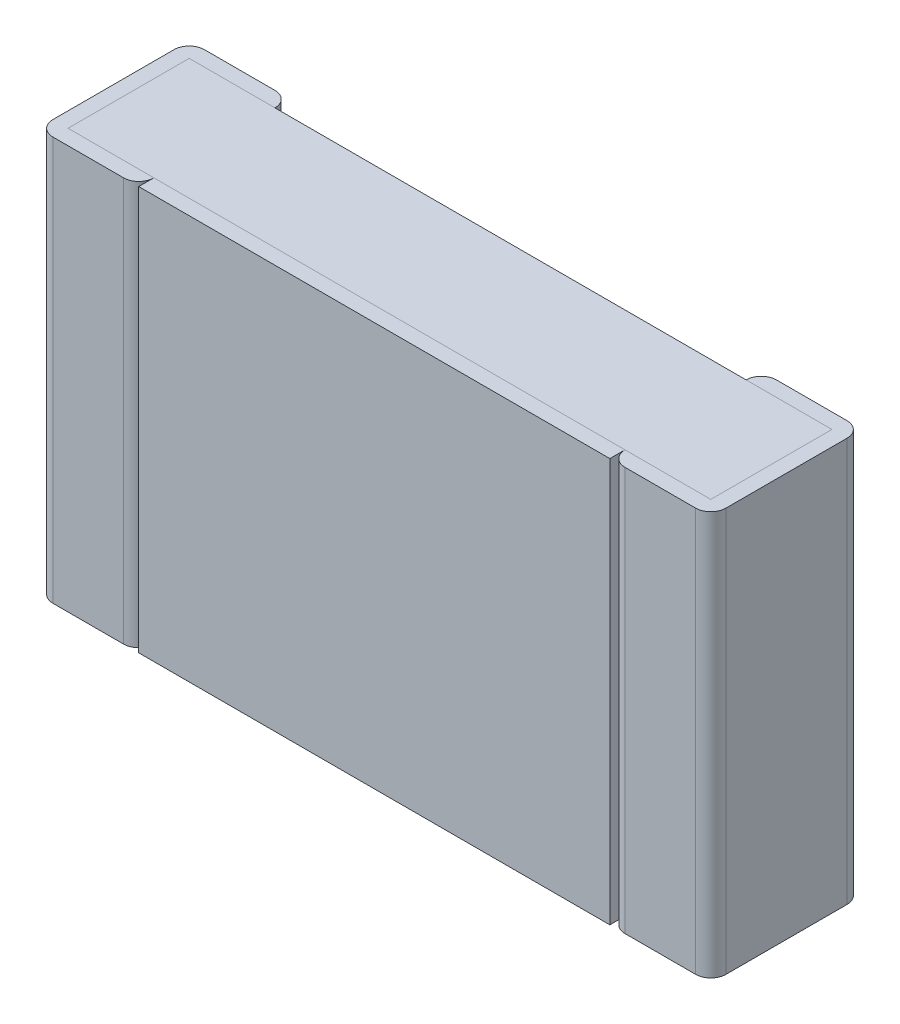
ISO-10303-21;
HEADER;
FILE_DESCRIPTION(('STEP AP214'),'2;1');
FILE_NAME('part.step','',(''),(''),'','','');
FILE_SCHEMA(('AUTOMOTIVE_DESIGN { 1 0 10303 214 1 1 1 1 }'));
ENDSEC;
DATA;
#1=APPLICATION_CONTEXT('core data for automotive mechanical design processes');
#2=APPLICATION_PROTOCOL_DEFINITION('international standard','automotive_design',2000,#1);
#3=PRODUCT_CONTEXT('',#1,'mechanical');
#4=PRODUCT('Part','Part','',(#3));
#5=PRODUCT_RELATED_PRODUCT_CATEGORY('part','',(#4));
#6=PRODUCT_DEFINITION_FORMATION('','',#4);
#7=PRODUCT_DEFINITION_CONTEXT('part definition',#1,'design');
#8=PRODUCT_DEFINITION('design','',#6,#7);
#9=PRODUCT_DEFINITION_SHAPE('','',#8);
#10=(LENGTH_UNIT() NAMED_UNIT(*) SI_UNIT(.MILLI.,.METRE.));
#11=(NAMED_UNIT(*) PLANE_ANGLE_UNIT() SI_UNIT($,.RADIAN.));
#12=(NAMED_UNIT(*) SI_UNIT($,.STERADIAN.) SOLID_ANGLE_UNIT());
#13=UNCERTAINTY_MEASURE_WITH_UNIT(LENGTH_MEASURE(1.E-05),#10,'distance_accuracy_value','');
#14=(GEOMETRIC_REPRESENTATION_CONTEXT(3) GLOBAL_UNCERTAINTY_ASSIGNED_CONTEXT((#13)) GLOBAL_UNIT_ASSIGNED_CONTEXT((#10,
#11,#12)) REPRESENTATION_CONTEXT('',''));
#15=CARTESIAN_POINT('',(0.,0.,0.));
#16=DIRECTION('',(0.,0.,1.));
#17=DIRECTION('',(1.,0.,0.));
#18=AXIS2_PLACEMENT_3D('',#15,#16,#17);
#19=CARTESIAN_POINT('',(-1.,-0.6,0.));
#20=DIRECTION('',(1.,0.,0.));
#21=DIRECTION('',(0.,1.,0.));
#22=AXIS2_PLACEMENT_3D('',#19,#20,#21);
#23=PLANE('',#22);
#24=DIRECTION('',(0.,1.,0.));
#25=VECTOR('',#24,1.);
#26=CARTESIAN_POINT('',(-1.,-0.6,0.405));
#27=LINE('',#26,#25);
#28=CARTESIAN_POINT('',(-1.,-0.6,0.405));
#29=VERTEX_POINT('',#28);
#30=CARTESIAN_POINT('',(-1.,0.6,0.405));
#31=VERTEX_POINT('',#30);
#32=EDGE_CURVE('E11',#29,#31,#27,.T.);
#33=ORIENTED_EDGE('',*,*,#32,.T.);
#34=DIRECTION('',(0.,0.,1.));
#35=VECTOR('',#34,1.);
#36=CARTESIAN_POINT('',(-1.,0.6,0.));
#37=LINE('',#36,#35);
#38=CARTESIAN_POINT('',(-1.,0.6,0.045));
#39=VERTEX_POINT('',#38);
#40=EDGE_CURVE('E41',#39,#31,#37,.T.);
#41=ORIENTED_EDGE('',*,*,#40,.F.);
#42=DIRECTION('',(0.,1.,0.));
#43=VECTOR('',#42,1.);
#44=CARTESIAN_POINT('',(-1.,-0.6,0.045));
#45=LINE('',#44,#43);
#46=CARTESIAN_POINT('',(-1.,-0.6,0.045));
#47=VERTEX_POINT('',#46);
#48=EDGE_CURVE('E301',#47,#39,#45,.T.);
#49=ORIENTED_EDGE('',*,*,#48,.F.);
#50=DIRECTION('',(0.,0.,1.));
#51=VECTOR('',#50,1.);
#52=CARTESIAN_POINT('',(-1.,-0.6,0.));
#53=LINE('',#52,#51);
#54=EDGE_CURVE('E27',#47,#29,#53,.T.);
#55=ORIENTED_EDGE('',*,*,#54,.T.);
#56=EDGE_LOOP('',(#33,#41,#49,#55));
#57=FACE_BOUND('',#56,.T.);
#58=ADVANCED_FACE('F16',(#57),#23,.F.);
#59=CARTESIAN_POINT('',(-1.,-0.6,0.));
#60=DIRECTION('',(0.,1.,0.));
#61=DIRECTION('',(1.,0.,0.));
#62=AXIS2_PLACEMENT_3D('',#59,#60,#61);
#63=PLANE('',#62);
#64=CARTESIAN_POINT('',(-0.745,-0.6,0.045));
#65=DIRECTION('',(0.,1.,0.));
#66=DIRECTION('',(0.,0.,1.));
#67=AXIS2_PLACEMENT_3D('',#64,#65,#66);
#68=CIRCLE('',#67,0.045);
#69=CARTESIAN_POINT('',(-0.7,-0.6,0.045));
#70=VERTEX_POINT('',#69);
#71=CARTESIAN_POINT('',(-0.745,-0.6,0.));
#72=VERTEX_POINT('',#71);
#73=EDGE_CURVE('E404',#70,#72,#68,.T.);
#74=ORIENTED_EDGE('',*,*,#73,.F.);
#75=DIRECTION('',(1.,0.,0.));
#76=VECTOR('',#75,1.);
#77=CARTESIAN_POINT('',(-0.955,-0.6,0.045));
#78=LINE('',#77,#76);
#79=CARTESIAN_POINT('',(-0.955,-0.6,0.045));
#80=VERTEX_POINT('',#79);
#81=EDGE_CURVE('E261',#80,#70,#78,.T.);
#82=ORIENTED_EDGE('',*,*,#81,.F.);
#83=DIRECTION('',(0.,0.,1.));
#84=VECTOR('',#83,1.);
#85=CARTESIAN_POINT('',(-0.955,-0.6,0.045));
#86=LINE('',#85,#84);
#87=CARTESIAN_POINT('',(-0.955,-0.6,0.405));
#88=VERTEX_POINT('',#87);
#89=EDGE_CURVE('E278',#80,#88,#86,.T.);
#90=ORIENTED_EDGE('',*,*,#89,.T.);
#91=DIRECTION('',(1.,0.,0.));
#92=VECTOR('',#91,1.);
#93=CARTESIAN_POINT('',(-0.955,-0.6,0.405));
#94=LINE('',#93,#92);
#95=CARTESIAN_POINT('',(-0.7,-0.6,0.405));
#96=VERTEX_POINT('',#95);
#97=EDGE_CURVE('E250',#88,#96,#94,.T.);
#98=ORIENTED_EDGE('',*,*,#97,.T.);
#99=CARTESIAN_POINT('',(-0.745,-0.6,0.405));
#100=DIRECTION('',(0.,-1.,0.));
#101=DIRECTION('',(0.,0.,1.));
#102=AXIS2_PLACEMENT_3D('',#99,#100,#101);
#103=CIRCLE('',#102,0.045);
#104=CARTESIAN_POINT('',(-0.745,-0.6,0.45));
#105=VERTEX_POINT('',#104);
#106=EDGE_CURVE('E247',#96,#105,#103,.T.);
#107=ORIENTED_EDGE('',*,*,#106,.T.);
#108=DIRECTION('',(1.,0.,0.));
#109=VECTOR('',#108,1.);
#110=CARTESIAN_POINT('',(-1.,-0.6,0.45));
#111=LINE('',#110,#109);
#112=CARTESIAN_POINT('',(-0.955,-0.6,0.45));
#113=VERTEX_POINT('',#112);
#114=EDGE_CURVE('E266',#113,#105,#111,.T.);
#115=ORIENTED_EDGE('',*,*,#114,.F.);
#116=CARTESIAN_POINT('',(-0.955,-0.6,0.405));
#117=DIRECTION('',(0.,1.,0.));
#118=DIRECTION('',(0.,0.,1.));
#119=AXIS2_PLACEMENT_3D('',#116,#117,#118);
#120=CIRCLE('',#119,0.045);
#121=EDGE_CURVE('E302',#29,#113,#120,.T.);
#122=ORIENTED_EDGE('',*,*,#121,.F.);
#123=ORIENTED_EDGE('',*,*,#54,.F.);
#124=CARTESIAN_POINT('',(-0.955,-0.6,0.045));
#125=DIRECTION('',(0.,-1.,0.));
#126=DIRECTION('',(0.,0.,1.));
#127=AXIS2_PLACEMENT_3D('',#124,#125,#126);
#128=CIRCLE('',#127,0.045);
#129=CARTESIAN_POINT('',(-0.955,-0.6,0.));
#130=VERTEX_POINT('',#129);
#131=EDGE_CURVE('E245',#47,#130,#128,.T.);
#132=ORIENTED_EDGE('',*,*,#131,.T.);
#133=DIRECTION('',(1.,0.,0.));
#134=VECTOR('',#133,1.);
#135=CARTESIAN_POINT('',(-1.,-0.6,0.));
#136=LINE('',#135,#134);
#137=EDGE_CURVE('E391',#130,#72,#136,.T.);
#138=ORIENTED_EDGE('',*,*,#137,.T.);
#139=EDGE_LOOP('',(#74,#82,#90,#98,#107,#115,#122,#123,#132,#138));
#140=FACE_BOUND('',#139,.T.);
#141=ADVANCED_FACE('F459',(#140),#63,.F.);
#142=CARTESIAN_POINT('',(-0.955,-0.6,0.045));
#143=DIRECTION('',(0.,1.,0.));
#144=DIRECTION('',(-1.,0.,0.));
#145=AXIS2_PLACEMENT_3D('',#142,#143,#144);
#146=CYLINDRICAL_SURFACE('',#145,0.045);
#147=ORIENTED_EDGE('',*,*,#48,.T.);
#148=CARTESIAN_POINT('',(-0.955,0.6,0.045));
#149=DIRECTION('',(0.,-1.,0.));
#150=DIRECTION('',(0.,0.,1.));
#151=AXIS2_PLACEMENT_3D('',#148,#149,#150);
#152=CIRCLE('',#151,0.045);
#153=CARTESIAN_POINT('',(-0.955,0.6,0.));
#154=VERTEX_POINT('',#153);
#155=EDGE_CURVE('E297',#39,#154,#152,.T.);
#156=ORIENTED_EDGE('',*,*,#155,.T.);
#157=DIRECTION('',(0.,1.,0.));
#158=VECTOR('',#157,1.);
#159=CARTESIAN_POINT('',(-0.955,-0.6,0.));
#160=LINE('',#159,#158);
#161=EDGE_CURVE('E418',#130,#154,#160,.T.);
#162=ORIENTED_EDGE('',*,*,#161,.F.);
#163=ORIENTED_EDGE('',*,*,#131,.F.);
#164=EDGE_LOOP('',(#147,#156,#162,#163));
#165=FACE_BOUND('',#164,.T.);
#166=ADVANCED_FACE('F462',(#165),#146,.T.);
#167=CARTESIAN_POINT('',(-0.955,-0.6,0.405));
#168=DIRECTION('',(0.,1.,0.));
#169=DIRECTION('',(-1.,0.,0.));
#170=AXIS2_PLACEMENT_3D('',#167,#168,#169);
#171=CYLINDRICAL_SURFACE('',#170,0.045);
#172=ORIENTED_EDGE('',*,*,#121,.T.);
#173=DIRECTION('',(0.,1.,0.));
#174=VECTOR('',#173,1.);
#175=CARTESIAN_POINT('',(-0.955,-0.6,0.45));
#176=LINE('',#175,#174);
#177=CARTESIAN_POINT('',(-0.955,0.6,0.45));
#178=VERTEX_POINT('',#177);
#179=EDGE_CURVE('E335',#113,#178,#176,.T.);
#180=ORIENTED_EDGE('',*,*,#179,.T.);
#181=CARTESIAN_POINT('',(-0.955,0.6,0.405));
#182=DIRECTION('',(0.,1.,0.));
#183=DIRECTION('',(0.,0.,1.));
#184=AXIS2_PLACEMENT_3D('',#181,#182,#183);
#185=CIRCLE('',#184,0.045);
#186=EDGE_CURVE('E259',#31,#178,#185,.T.);
#187=ORIENTED_EDGE('',*,*,#186,.F.);
#188=ORIENTED_EDGE('',*,*,#32,.F.);
#189=EDGE_LOOP('',(#172,#180,#187,#188));
#190=FACE_BOUND('',#189,.T.);
#191=ADVANCED_FACE('F470',(#190),#171,.T.);
#192=CARTESIAN_POINT('',(-1.,0.6,0.));
#193=DIRECTION('',(0.,1.,0.));
#194=DIRECTION('',(1.,0.,0.));
#195=AXIS2_PLACEMENT_3D('',#192,#193,#194);
#196=PLANE('',#195);
#197=DIRECTION('',(1.,0.,0.));
#198=VECTOR('',#197,1.);
#199=CARTESIAN_POINT('',(-1.,0.6,0.));
#200=LINE('',#199,#198);
#201=CARTESIAN_POINT('',(-0.745,0.6,0.));
#202=VERTEX_POINT('',#201);
#203=EDGE_CURVE('E407',#154,#202,#200,.T.);
#204=ORIENTED_EDGE('',*,*,#203,.F.);
#205=ORIENTED_EDGE('',*,*,#155,.F.);
#206=ORIENTED_EDGE('',*,*,#40,.T.);
#207=ORIENTED_EDGE('',*,*,#186,.T.);
#208=DIRECTION('',(1.,0.,0.));
#209=VECTOR('',#208,1.);
#210=CARTESIAN_POINT('',(-1.,0.6,0.45));
#211=LINE('',#210,#209);
#212=CARTESIAN_POINT('',(-0.745,0.6,0.45));
#213=VERTEX_POINT('',#212);
#214=EDGE_CURVE('E255',#178,#213,#211,.T.);
#215=ORIENTED_EDGE('',*,*,#214,.T.);
#216=CARTESIAN_POINT('',(-0.745,0.6,0.405));
#217=DIRECTION('',(0.,-1.,0.));
#218=DIRECTION('',(0.,0.,1.));
#219=AXIS2_PLACEMENT_3D('',#216,#217,#218);
#220=CIRCLE('',#219,0.045);
#221=CARTESIAN_POINT('',(-0.7,0.6,0.405));
#222=VERTEX_POINT('',#221);
#223=EDGE_CURVE('E286',#222,#213,#220,.T.);
#224=ORIENTED_EDGE('',*,*,#223,.F.);
#225=DIRECTION('',(1.,0.,0.));
#226=VECTOR('',#225,1.);
#227=CARTESIAN_POINT('',(-0.955,0.6,0.405));
#228=LINE('',#227,#226);
#229=CARTESIAN_POINT('',(-0.955,0.6,0.405));
#230=VERTEX_POINT('',#229);
#231=EDGE_CURVE('E336',#230,#222,#228,.T.);
#232=ORIENTED_EDGE('',*,*,#231,.F.);
#233=DIRECTION('',(0.,0.,1.));
#234=VECTOR('',#233,1.);
#235=CARTESIAN_POINT('',(-0.955,0.6,0.045));
#236=LINE('',#235,#234);
#237=CARTESIAN_POINT('',(-0.955,0.6,0.045));
#238=VERTEX_POINT('',#237);
#239=EDGE_CURVE('E340',#238,#230,#236,.T.);
#240=ORIENTED_EDGE('',*,*,#239,.F.);
#241=DIRECTION('',(1.,0.,0.));
#242=VECTOR('',#241,1.);
#243=CARTESIAN_POINT('',(-0.955,0.6,0.045));
#244=LINE('',#243,#242);
#245=CARTESIAN_POINT('',(-0.7,0.6,0.045));
#246=VERTEX_POINT('',#245);
#247=EDGE_CURVE('E260',#238,#246,#244,.T.);
#248=ORIENTED_EDGE('',*,*,#247,.T.);
#249=CARTESIAN_POINT('',(-0.745,0.6,0.045));
#250=DIRECTION('',(0.,1.,0.));
#251=DIRECTION('',(0.,0.,1.));
#252=AXIS2_PLACEMENT_3D('',#249,#250,#251);
#253=CIRCLE('',#252,0.045);
#254=EDGE_CURVE('E425',#246,#202,#253,.T.);
#255=ORIENTED_EDGE('',*,*,#254,.T.);
#256=EDGE_LOOP('',(#204,#205,#206,#207,#215,#224,#232,#240,#248,#255));
#257=FACE_BOUND('',#256,.T.);
#258=ADVANCED_FACE('F451',(#257),#196,.T.);
#259=CARTESIAN_POINT('',(-1.,-0.6,0.));
#260=DIRECTION('',(0.,0.,1.));
#261=DIRECTION('',(1.,0.,0.));
#262=AXIS2_PLACEMENT_3D('',#259,#260,#261);
#263=PLANE('',#262);
#264=DIRECTION('',(0.,1.,0.));
#265=VECTOR('',#264,1.);
#266=CARTESIAN_POINT('',(-0.745,-0.6,0.));
#267=LINE('',#266,#265);
#268=EDGE_CURVE('E408',#72,#202,#267,.T.);
#269=ORIENTED_EDGE('',*,*,#268,.F.);
#270=ORIENTED_EDGE('',*,*,#137,.F.);
#271=ORIENTED_EDGE('',*,*,#161,.T.);
#272=ORIENTED_EDGE('',*,*,#203,.T.);
#273=EDGE_LOOP('',(#269,#270,#271,#272));
#274=FACE_BOUND('',#273,.T.);
#275=ADVANCED_FACE('F510',(#274),#263,.F.);
#276=CARTESIAN_POINT('',(-0.745,-0.6,0.045));
#277=DIRECTION('',(0.,1.,0.));
#278=DIRECTION('',(1.,0.,0.));
#279=AXIS2_PLACEMENT_3D('',#276,#277,#278);
#280=CYLINDRICAL_SURFACE('',#279,0.045);
#281=ORIENTED_EDGE('',*,*,#73,.T.);
#282=ORIENTED_EDGE('',*,*,#268,.T.);
#283=ORIENTED_EDGE('',*,*,#254,.F.);
#284=DIRECTION('',(0.,1.,0.));
#285=VECTOR('',#284,1.);
#286=CARTESIAN_POINT('',(-0.7,-0.6,0.045));
#287=LINE('',#286,#285);
#288=EDGE_CURVE('E292',#70,#246,#287,.T.);
#289=ORIENTED_EDGE('',*,*,#288,.F.);
#290=EDGE_LOOP('',(#281,#282,#283,#289));
#291=FACE_BOUND('',#290,.T.);
#292=ADVANCED_FACE('F513',(#291),#280,.T.);
#293=CARTESIAN_POINT('',(-0.955,-0.6,0.045));
#294=DIRECTION('',(0.,1.,0.));
#295=DIRECTION('',(1.,0.,0.));
#296=AXIS2_PLACEMENT_3D('',#293,#294,#295);
#297=PLANE('',#296);
#298=DIRECTION('',(1.,0.,0.));
#299=VECTOR('',#298,1.);
#300=CARTESIAN_POINT('',(-0.955,-0.6,0.045));
#301=LINE('',#300,#299);
#302=CARTESIAN_POINT('',(0.7,-0.6,0.045));
#303=VERTEX_POINT('',#302);
#304=EDGE_CURVE('E282',#70,#303,#301,.T.);
#305=ORIENTED_EDGE('',*,*,#304,.T.);
#306=DIRECTION('',(1.,0.,0.));
#307=VECTOR('',#306,1.);
#308=CARTESIAN_POINT('',(-0.955,-0.6,0.045));
#309=LINE('',#308,#307);
#310=CARTESIAN_POINT('',(0.955,-0.6,0.045));
#311=VERTEX_POINT('',#310);
#312=EDGE_CURVE('E279',#303,#311,#309,.T.);
#313=ORIENTED_EDGE('',*,*,#312,.T.);
#314=DIRECTION('',(0.,0.,1.));
#315=VECTOR('',#314,1.);
#316=CARTESIAN_POINT('',(0.955,-0.6,0.045));
#317=LINE('',#316,#315);
#318=CARTESIAN_POINT('',(0.955,-0.6,0.405));
#319=VERTEX_POINT('',#318);
#320=EDGE_CURVE('E265',#311,#319,#317,.T.);
#321=ORIENTED_EDGE('',*,*,#320,.T.);
#322=DIRECTION('',(1.,0.,0.));
#323=VECTOR('',#322,1.);
#324=CARTESIAN_POINT('',(-0.955,-0.6,0.405));
#325=LINE('',#324,#323);
#326=CARTESIAN_POINT('',(0.7,-0.6,0.405));
#327=VERTEX_POINT('',#326);
#328=EDGE_CURVE('E273',#327,#319,#325,.T.);
#329=ORIENTED_EDGE('',*,*,#328,.F.);
#330=DIRECTION('',(1.,0.,0.));
#331=VECTOR('',#330,1.);
#332=CARTESIAN_POINT('',(-0.7,-0.6,0.405));
#333=LINE('',#332,#331);
#334=EDGE_CURVE('E214',#96,#327,#333,.T.);
#335=ORIENTED_EDGE('',*,*,#334,.F.);
#336=ORIENTED_EDGE('',*,*,#97,.F.);
#337=ORIENTED_EDGE('',*,*,#89,.F.);
#338=ORIENTED_EDGE('',*,*,#81,.T.);
#339=EDGE_LOOP('',(#305,#313,#321,#329,#335,#336,#337,#338));
#340=FACE_BOUND('',#339,.T.);
#341=ADVANCED_FACE('F519',(#340),#297,.F.);
#342=CARTESIAN_POINT('',(-1.,-0.6,0.45));
#343=DIRECTION('',(0.,0.,1.));
#344=DIRECTION('',(1.,0.,0.));
#345=AXIS2_PLACEMENT_3D('',#342,#343,#344);
#346=PLANE('',#345);
#347=ORIENTED_EDGE('',*,*,#214,.F.);
#348=ORIENTED_EDGE('',*,*,#179,.F.);
#349=ORIENTED_EDGE('',*,*,#114,.T.);
#350=DIRECTION('',(0.,1.,0.));
#351=VECTOR('',#350,1.);
#352=CARTESIAN_POINT('',(-0.745,-0.6,0.45));
#353=LINE('',#352,#351);
#354=EDGE_CURVE('E285',#105,#213,#353,.T.);
#355=ORIENTED_EDGE('',*,*,#354,.T.);
#356=EDGE_LOOP('',(#347,#348,#349,#355));
#357=FACE_BOUND('',#356,.T.);
#358=ADVANCED_FACE('F455',(#357),#346,.T.);
#359=CARTESIAN_POINT('',(-0.745,-0.6,0.405));
#360=DIRECTION('',(0.,1.,0.));
#361=DIRECTION('',(1.,0.,0.));
#362=AXIS2_PLACEMENT_3D('',#359,#360,#361);
#363=CYLINDRICAL_SURFACE('',#362,0.045);
#364=DIRECTION('',(0.,1.,0.));
#365=VECTOR('',#364,1.);
#366=CARTESIAN_POINT('',(-0.7,-0.6,0.405));
#367=LINE('',#366,#365);
#368=EDGE_CURVE('E205',#96,#222,#367,.T.);
#369=ORIENTED_EDGE('',*,*,#368,.T.);
#370=ORIENTED_EDGE('',*,*,#223,.T.);
#371=ORIENTED_EDGE('',*,*,#354,.F.);
#372=ORIENTED_EDGE('',*,*,#106,.F.);
#373=EDGE_LOOP('',(#369,#370,#371,#372));
#374=FACE_BOUND('',#373,.T.);
#375=ADVANCED_FACE('F448',(#374),#363,.T.);
#376=CARTESIAN_POINT('',(-0.955,0.6,0.045));
#377=DIRECTION('',(0.,1.,0.));
#378=DIRECTION('',(1.,0.,0.));
#379=AXIS2_PLACEMENT_3D('',#376,#377,#378);
#380=PLANE('',#379);
#381=ORIENTED_EDGE('',*,*,#247,.F.);
#382=ORIENTED_EDGE('',*,*,#239,.T.);
#383=ORIENTED_EDGE('',*,*,#231,.T.);
#384=DIRECTION('',(1.,0.,0.));
#385=VECTOR('',#384,1.);
#386=CARTESIAN_POINT('',(-0.7,0.6,0.405));
#387=LINE('',#386,#385);
#388=CARTESIAN_POINT('',(0.7,0.6,0.405));
#389=VERTEX_POINT('',#388);
#390=EDGE_CURVE('E341',#222,#389,#387,.T.);
#391=ORIENTED_EDGE('',*,*,#390,.T.);
#392=DIRECTION('',(1.,0.,0.));
#393=VECTOR('',#392,1.);
#394=CARTESIAN_POINT('',(-0.955,0.6,0.405));
#395=LINE('',#394,#393);
#396=CARTESIAN_POINT('',(0.955,0.6,0.405));
#397=VERTEX_POINT('',#396);
#398=EDGE_CURVE('E291',#389,#397,#395,.T.);
#399=ORIENTED_EDGE('',*,*,#398,.T.);
#400=DIRECTION('',(0.,0.,1.));
#401=VECTOR('',#400,1.);
#402=CARTESIAN_POINT('',(0.955,0.6,0.045));
#403=LINE('',#402,#401);
#404=CARTESIAN_POINT('',(0.955,0.6,0.045));
#405=VERTEX_POINT('',#404);
#406=EDGE_CURVE('E254',#405,#397,#403,.T.);
#407=ORIENTED_EDGE('',*,*,#406,.F.);
#408=DIRECTION('',(1.,0.,0.));
#409=VECTOR('',#408,1.);
#410=CARTESIAN_POINT('',(-0.955,0.6,0.045));
#411=LINE('',#410,#409);
#412=CARTESIAN_POINT('',(0.7,0.6,0.045));
#413=VERTEX_POINT('',#412);
#414=EDGE_CURVE('E208',#413,#405,#411,.T.);
#415=ORIENTED_EDGE('',*,*,#414,.F.);
#416=DIRECTION('',(1.,0.,0.));
#417=VECTOR('',#416,1.);
#418=CARTESIAN_POINT('',(-0.955,0.6,0.045));
#419=LINE('',#418,#417);
#420=EDGE_CURVE('E287',#246,#413,#419,.T.);
#421=ORIENTED_EDGE('',*,*,#420,.F.);
#422=EDGE_LOOP('',(#381,#382,#383,#391,#399,#407,#415,#421));
#423=FACE_BOUND('',#422,.T.);
#424=ADVANCED_FACE('F380',(#423),#380,.T.);
#425=CARTESIAN_POINT('',(-0.955,-0.6,0.045));
#426=DIRECTION('',(0.,0.,1.));
#427=DIRECTION('',(1.,0.,0.));
#428=AXIS2_PLACEMENT_3D('',#425,#426,#427);
#429=PLANE('',#428);
#430=ORIENTED_EDGE('',*,*,#420,.T.);
#431=DIRECTION('',(0.,1.,0.));
#432=VECTOR('',#431,1.);
#433=CARTESIAN_POINT('',(0.7,-0.6,0.045));
#434=LINE('',#433,#432);
#435=EDGE_CURVE('E312',#303,#413,#434,.T.);
#436=ORIENTED_EDGE('',*,*,#435,.F.);
#437=ORIENTED_EDGE('',*,*,#304,.F.);
#438=ORIENTED_EDGE('',*,*,#288,.T.);
#439=EDGE_LOOP('',(#430,#436,#437,#438));
#440=FACE_BOUND('',#439,.T.);
#441=ADVANCED_FACE('F488',(#440),#429,.F.);
#442=CARTESIAN_POINT('',(0.7,-0.6,0.));
#443=DIRECTION('',(0.,1.,0.));
#444=DIRECTION('',(1.,0.,0.));
#445=AXIS2_PLACEMENT_3D('',#442,#443,#444);
#446=PLANE('',#445);
#447=CARTESIAN_POINT('',(0.955,-0.6,0.045));
#448=DIRECTION('',(0.,1.,0.));
#449=DIRECTION('',(0.,0.,1.));
#450=AXIS2_PLACEMENT_3D('',#447,#448,#449);
#451=CIRCLE('',#450,0.045);
#452=CARTESIAN_POINT('',(1.,-0.6,0.045));
#453=VERTEX_POINT('',#452);
#454=CARTESIAN_POINT('',(0.955,-0.6,0.));
#455=VERTEX_POINT('',#454);
#456=EDGE_CURVE('E303',#453,#455,#451,.T.);
#457=ORIENTED_EDGE('',*,*,#456,.F.);
#458=DIRECTION('',(0.,0.,1.));
#459=VECTOR('',#458,1.);
#460=CARTESIAN_POINT('',(1.,-0.6,0.));
#461=LINE('',#460,#459);
#462=CARTESIAN_POINT('',(1.,-0.6,0.405));
#463=VERTEX_POINT('',#462);
#464=EDGE_CURVE('E329',#453,#463,#461,.T.);
#465=ORIENTED_EDGE('',*,*,#464,.T.);
#466=CARTESIAN_POINT('',(0.955,-0.6,0.405));
#467=DIRECTION('',(0.,-1.,0.));
#468=DIRECTION('',(0.,0.,1.));
#469=AXIS2_PLACEMENT_3D('',#466,#467,#468);
#470=CIRCLE('',#469,0.045);
#471=CARTESIAN_POINT('',(0.955,-0.6,0.45));
#472=VERTEX_POINT('',#471);
#473=EDGE_CURVE('E331',#463,#472,#470,.T.);
#474=ORIENTED_EDGE('',*,*,#473,.T.);
#475=DIRECTION('',(1.,0.,0.));
#476=VECTOR('',#475,1.);
#477=CARTESIAN_POINT('',(0.7,-0.6,0.45));
#478=LINE('',#477,#476);
#479=CARTESIAN_POINT('',(0.745,-0.6,0.45));
#480=VERTEX_POINT('',#479);
#481=EDGE_CURVE('E234',#480,#472,#478,.T.);
#482=ORIENTED_EDGE('',*,*,#481,.F.);
#483=CARTESIAN_POINT('',(0.745,-0.6,0.405));
#484=DIRECTION('',(0.,1.,0.));
#485=DIRECTION('',(0.,0.,1.));
#486=AXIS2_PLACEMENT_3D('',#483,#484,#485);
#487=CIRCLE('',#486,0.045);
#488=EDGE_CURVE('E346',#327,#480,#487,.T.);
#489=ORIENTED_EDGE('',*,*,#488,.F.);
#490=ORIENTED_EDGE('',*,*,#328,.T.);
#491=ORIENTED_EDGE('',*,*,#320,.F.);
#492=ORIENTED_EDGE('',*,*,#312,.F.);
#493=CARTESIAN_POINT('',(0.745,-0.6,0.045));
#494=DIRECTION('',(0.,-1.,0.));
#495=DIRECTION('',(0.,0.,1.));
#496=AXIS2_PLACEMENT_3D('',#493,#494,#495);
#497=CIRCLE('',#496,0.045);
#498=CARTESIAN_POINT('',(0.745,-0.6,0.));
#499=VERTEX_POINT('',#498);
#500=EDGE_CURVE('E269',#303,#499,#497,.T.);
#501=ORIENTED_EDGE('',*,*,#500,.T.);
#502=DIRECTION('',(1.,0.,0.));
#503=VECTOR('',#502,1.);
#504=CARTESIAN_POINT('',(0.7,-0.6,0.));
#505=LINE('',#504,#503);
#506=EDGE_CURVE('E274',#499,#455,#505,.T.);
#507=ORIENTED_EDGE('',*,*,#506,.T.);
#508=EDGE_LOOP('',(#457,#465,#474,#482,#489,#490,#491,#492,#501,#507));
#509=FACE_BOUND('',#508,.T.);
#510=ADVANCED_FACE('F480',(#509),#446,.F.);
#511=CARTESIAN_POINT('',(-0.7,-0.6,0.405));
#512=DIRECTION('',(0.,1.,0.));
#513=DIRECTION('',(1.,0.,0.));
#514=AXIS2_PLACEMENT_3D('',#511,#512,#513);
#515=PLANE('',#514);
#516=DIRECTION('',(0.,0.,1.));
#517=VECTOR('',#516,1.);
#518=CARTESIAN_POINT('',(0.7,-0.6,0.405));
#519=LINE('',#518,#517);
#520=CARTESIAN_POINT('',(0.7,-0.6,0.45));
#521=VERTEX_POINT('',#520);
#522=EDGE_CURVE('E188',#327,#521,#519,.T.);
#523=ORIENTED_EDGE('',*,*,#522,.T.);
#524=DIRECTION('',(1.,0.,0.));
#525=VECTOR('',#524,1.);
#526=CARTESIAN_POINT('',(-0.7,-0.6,0.45));
#527=LINE('',#526,#525);
#528=CARTESIAN_POINT('',(-0.7,-0.6,0.45));
#529=VERTEX_POINT('',#528);
#530=EDGE_CURVE('E182',#529,#521,#527,.T.);
#531=ORIENTED_EDGE('',*,*,#530,.F.);
#532=DIRECTION('',(0.,0.,1.));
#533=VECTOR('',#532,1.);
#534=CARTESIAN_POINT('',(-0.7,-0.6,0.405));
#535=LINE('',#534,#533);
#536=EDGE_CURVE('E186',#96,#529,#535,.T.);
#537=ORIENTED_EDGE('',*,*,#536,.F.);
#538=ORIENTED_EDGE('',*,*,#334,.T.);
#539=EDGE_LOOP('',(#523,#531,#537,#538));
#540=FACE_BOUND('',#539,.T.);
#541=ADVANCED_FACE('F184',(#540),#515,.F.);
#542=CARTESIAN_POINT('',(-0.7,-0.6,0.405));
#543=DIRECTION('',(1.,0.,0.));
#544=DIRECTION('',(0.,1.,0.));
#545=AXIS2_PLACEMENT_3D('',#542,#543,#544);
#546=PLANE('',#545);
#547=DIRECTION('',(0.,1.,0.));
#548=VECTOR('',#547,1.);
#549=CARTESIAN_POINT('',(-0.7,-0.6,0.45));
#550=LINE('',#549,#548);
#551=CARTESIAN_POINT('',(-0.7,0.6,0.45));
#552=VERTEX_POINT('',#551);
#553=EDGE_CURVE('E202',#529,#552,#550,.T.);
#554=ORIENTED_EDGE('',*,*,#553,.T.);
#555=DIRECTION('',(0.,0.,1.));
#556=VECTOR('',#555,1.);
#557=CARTESIAN_POINT('',(-0.7,0.6,0.405));
#558=LINE('',#557,#556);
#559=EDGE_CURVE('E311',#222,#552,#558,.T.);
#560=ORIENTED_EDGE('',*,*,#559,.F.);
#561=ORIENTED_EDGE('',*,*,#368,.F.);
#562=ORIENTED_EDGE('',*,*,#536,.T.);
#563=EDGE_LOOP('',(#554,#560,#561,#562));
#564=FACE_BOUND('',#563,.T.);
#565=ADVANCED_FACE('F200',(#564),#546,.F.);
#566=CARTESIAN_POINT('',(0.7,0.6,0.));
#567=DIRECTION('',(0.,1.,0.));
#568=DIRECTION('',(1.,0.,0.));
#569=AXIS2_PLACEMENT_3D('',#566,#567,#568);
#570=PLANE('',#569);
#571=DIRECTION('',(1.,0.,0.));
#572=VECTOR('',#571,1.);
#573=CARTESIAN_POINT('',(0.7,0.6,0.));
#574=LINE('',#573,#572);
#575=CARTESIAN_POINT('',(0.745,0.6,0.));
#576=VERTEX_POINT('',#575);
#577=CARTESIAN_POINT('',(0.955,0.6,0.));
#578=VERTEX_POINT('',#577);
#579=EDGE_CURVE('E306',#576,#578,#574,.T.);
#580=ORIENTED_EDGE('',*,*,#579,.F.);
#581=CARTESIAN_POINT('',(0.745,0.6,0.045));
#582=DIRECTION('',(0.,-1.,0.));
#583=DIRECTION('',(0.,0.,1.));
#584=AXIS2_PLACEMENT_3D('',#581,#582,#583);
#585=CIRCLE('',#584,0.045);
#586=EDGE_CURVE('E443',#413,#576,#585,.T.);
#587=ORIENTED_EDGE('',*,*,#586,.F.);
#588=ORIENTED_EDGE('',*,*,#414,.T.);
#589=ORIENTED_EDGE('',*,*,#406,.T.);
#590=ORIENTED_EDGE('',*,*,#398,.F.);
#591=CARTESIAN_POINT('',(0.745,0.6,0.405));
#592=DIRECTION('',(0.,1.,0.));
#593=DIRECTION('',(0.,0.,1.));
#594=AXIS2_PLACEMENT_3D('',#591,#592,#593);
#595=CIRCLE('',#594,0.045);
#596=CARTESIAN_POINT('',(0.745,0.6,0.45));
#597=VERTEX_POINT('',#596);
#598=EDGE_CURVE('E366',#389,#597,#595,.T.);
#599=ORIENTED_EDGE('',*,*,#598,.T.);
#600=DIRECTION('',(1.,0.,0.));
#601=VECTOR('',#600,1.);
#602=CARTESIAN_POINT('',(0.7,0.6,0.45));
#603=LINE('',#602,#601);
#604=CARTESIAN_POINT('',(0.955,0.6,0.45));
#605=VERTEX_POINT('',#604);
#606=EDGE_CURVE('E371',#597,#605,#603,.T.);
#607=ORIENTED_EDGE('',*,*,#606,.T.);
#608=CARTESIAN_POINT('',(0.955,0.6,0.405));
#609=DIRECTION('',(0.,-1.,0.));
#610=DIRECTION('',(0.,0.,1.));
#611=AXIS2_PLACEMENT_3D('',#608,#609,#610);
#612=CIRCLE('',#611,0.045);
#613=CARTESIAN_POINT('',(1.,0.6,0.405));
#614=VERTEX_POINT('',#613);
#615=EDGE_CURVE('E224',#614,#605,#612,.T.);
#616=ORIENTED_EDGE('',*,*,#615,.F.);
#617=DIRECTION('',(0.,0.,1.));
#618=VECTOR('',#617,1.);
#619=CARTESIAN_POINT('',(1.,0.6,0.));
#620=LINE('',#619,#618);
#621=CARTESIAN_POINT('',(1.,0.6,0.045));
#622=VERTEX_POINT('',#621);
#623=EDGE_CURVE('E223',#622,#614,#620,.T.);
#624=ORIENTED_EDGE('',*,*,#623,.F.);
#625=CARTESIAN_POINT('',(0.955,0.6,0.045));
#626=DIRECTION('',(0.,1.,0.));
#627=DIRECTION('',(0.,0.,1.));
#628=AXIS2_PLACEMENT_3D('',#625,#626,#627);
#629=CIRCLE('',#628,0.045);
#630=EDGE_CURVE('E413',#622,#578,#629,.T.);
#631=ORIENTED_EDGE('',*,*,#630,.T.);
#632=EDGE_LOOP('',(#580,#587,#588,#589,#590,#599,#607,#616,#624,#631));
#633=FACE_BOUND('',#632,.T.);
#634=ADVANCED_FACE('F375',(#633),#570,.T.);
#635=CARTESIAN_POINT('',(-0.7,0.6,0.405));
#636=DIRECTION('',(0.,1.,0.));
#637=DIRECTION('',(1.,0.,0.));
#638=AXIS2_PLACEMENT_3D('',#635,#636,#637);
#639=PLANE('',#638);
#640=ORIENTED_EDGE('',*,*,#390,.F.);
#641=ORIENTED_EDGE('',*,*,#559,.T.);
#642=DIRECTION('',(1.,0.,0.));
#643=VECTOR('',#642,1.);
#644=CARTESIAN_POINT('',(-0.7,0.6,0.45));
#645=LINE('',#644,#643);
#646=CARTESIAN_POINT('',(0.7,0.6,0.45));
#647=VERTEX_POINT('',#646);
#648=EDGE_CURVE('E212',#552,#647,#645,.T.);
#649=ORIENTED_EDGE('',*,*,#648,.T.);
#650=DIRECTION('',(0.,0.,1.));
#651=VECTOR('',#650,1.);
#652=CARTESIAN_POINT('',(0.7,0.6,0.405));
#653=LINE('',#652,#651);
#654=EDGE_CURVE('E194',#389,#647,#653,.T.);
#655=ORIENTED_EDGE('',*,*,#654,.F.);
#656=EDGE_LOOP('',(#640,#641,#649,#655));
#657=FACE_BOUND('',#656,.T.);
#658=ADVANCED_FACE('F532',(#657),#639,.T.);
#659=CARTESIAN_POINT('',(0.745,-0.6,0.045));
#660=DIRECTION('',(0.,1.,0.));
#661=DIRECTION('',(-1.,0.,0.));
#662=AXIS2_PLACEMENT_3D('',#659,#660,#661);
#663=CYLINDRICAL_SURFACE('',#662,0.045);
#664=ORIENTED_EDGE('',*,*,#435,.T.);
#665=ORIENTED_EDGE('',*,*,#586,.T.);
#666=DIRECTION('',(0.,1.,0.));
#667=VECTOR('',#666,1.);
#668=CARTESIAN_POINT('',(0.745,-0.6,0.));
#669=LINE('',#668,#667);
#670=EDGE_CURVE('E441',#499,#576,#669,.T.);
#671=ORIENTED_EDGE('',*,*,#670,.F.);
#672=ORIENTED_EDGE('',*,*,#500,.F.);
#673=EDGE_LOOP('',(#664,#665,#671,#672));
#674=FACE_BOUND('',#673,.T.);
#675=ADVANCED_FACE('F18',(#674),#663,.T.);
#676=CARTESIAN_POINT('',(0.7,-0.6,0.));
#677=DIRECTION('',(0.,0.,1.));
#678=DIRECTION('',(1.,0.,0.));
#679=AXIS2_PLACEMENT_3D('',#676,#677,#678);
#680=PLANE('',#679);
#681=DIRECTION('',(0.,1.,0.));
#682=VECTOR('',#681,1.);
#683=CARTESIAN_POINT('',(0.955,-0.6,0.));
#684=LINE('',#683,#682);
#685=EDGE_CURVE('E307',#455,#578,#684,.T.);
#686=ORIENTED_EDGE('',*,*,#685,.F.);
#687=ORIENTED_EDGE('',*,*,#506,.F.);
#688=ORIENTED_EDGE('',*,*,#670,.T.);
#689=ORIENTED_EDGE('',*,*,#579,.T.);
#690=EDGE_LOOP('',(#686,#687,#688,#689));
#691=FACE_BOUND('',#690,.T.);
#692=ADVANCED_FACE('F492',(#691),#680,.F.);
#693=CARTESIAN_POINT('',(0.955,-0.6,0.045));
#694=DIRECTION('',(0.,1.,0.));
#695=DIRECTION('',(1.,0.,0.));
#696=AXIS2_PLACEMENT_3D('',#693,#694,#695);
#697=CYLINDRICAL_SURFACE('',#696,0.045);
#698=ORIENTED_EDGE('',*,*,#456,.T.);
#699=ORIENTED_EDGE('',*,*,#685,.T.);
#700=ORIENTED_EDGE('',*,*,#630,.F.);
#701=DIRECTION('',(0.,1.,0.));
#702=VECTOR('',#701,1.);
#703=CARTESIAN_POINT('',(1.,-0.6,0.045));
#704=LINE('',#703,#702);
#705=EDGE_CURVE('E231',#453,#622,#704,.T.);
#706=ORIENTED_EDGE('',*,*,#705,.F.);
#707=EDGE_LOOP('',(#698,#699,#700,#706));
#708=FACE_BOUND('',#707,.T.);
#709=ADVANCED_FACE('F495',(#708),#697,.T.);
#710=CARTESIAN_POINT('',(1.,-0.6,0.));
#711=DIRECTION('',(1.,0.,0.));
#712=DIRECTION('',(0.,1.,0.));
#713=AXIS2_PLACEMENT_3D('',#710,#711,#712);
#714=PLANE('',#713);
#715=ORIENTED_EDGE('',*,*,#464,.F.);
#716=ORIENTED_EDGE('',*,*,#705,.T.);
#717=ORIENTED_EDGE('',*,*,#623,.T.);
#718=DIRECTION('',(0.,1.,0.));
#719=VECTOR('',#718,1.);
#720=CARTESIAN_POINT('',(1.,-0.6,0.405));
#721=LINE('',#720,#719);
#722=EDGE_CURVE('E221',#463,#614,#721,.T.);
#723=ORIENTED_EDGE('',*,*,#722,.F.);
#724=EDGE_LOOP('',(#715,#716,#717,#723));
#725=FACE_BOUND('',#724,.T.);
#726=ADVANCED_FACE('F499',(#725),#714,.T.);
#727=CARTESIAN_POINT('',(0.955,-0.6,0.405));
#728=DIRECTION('',(0.,1.,0.));
#729=DIRECTION('',(1.,0.,0.));
#730=AXIS2_PLACEMENT_3D('',#727,#728,#729);
#731=CYLINDRICAL_SURFACE('',#730,0.045);
#732=ORIENTED_EDGE('',*,*,#722,.T.);
#733=ORIENTED_EDGE('',*,*,#615,.T.);
#734=DIRECTION('',(0.,1.,0.));
#735=VECTOR('',#734,1.);
#736=CARTESIAN_POINT('',(0.955,-0.6,0.45));
#737=LINE('',#736,#735);
#738=EDGE_CURVE('E20',#472,#605,#737,.T.);
#739=ORIENTED_EDGE('',*,*,#738,.F.);
#740=ORIENTED_EDGE('',*,*,#473,.F.);
#741=EDGE_LOOP('',(#732,#733,#739,#740));
#742=FACE_BOUND('',#741,.T.);
#743=ADVANCED_FACE('F483',(#742),#731,.T.);
#744=CARTESIAN_POINT('',(0.7,-0.6,0.45));
#745=DIRECTION('',(0.,0.,1.));
#746=DIRECTION('',(1.,0.,0.));
#747=AXIS2_PLACEMENT_3D('',#744,#745,#746);
#748=PLANE('',#747);
#749=ORIENTED_EDGE('',*,*,#606,.F.);
#750=DIRECTION('',(0.,1.,0.));
#751=VECTOR('',#750,1.);
#752=CARTESIAN_POINT('',(0.745,-0.6,0.45));
#753=LINE('',#752,#751);
#754=EDGE_CURVE('E342',#480,#597,#753,.T.);
#755=ORIENTED_EDGE('',*,*,#754,.F.);
#756=ORIENTED_EDGE('',*,*,#481,.T.);
#757=ORIENTED_EDGE('',*,*,#738,.T.);
#758=EDGE_LOOP('',(#749,#755,#756,#757));
#759=FACE_BOUND('',#758,.T.);
#760=ADVANCED_FACE('F481',(#759),#748,.T.);
#761=CARTESIAN_POINT('',(0.745,-0.6,0.405));
#762=DIRECTION('',(0.,1.,0.));
#763=DIRECTION('',(-1.,0.,0.));
#764=AXIS2_PLACEMENT_3D('',#761,#762,#763);
#765=CYLINDRICAL_SURFACE('',#764,0.045);
#766=ORIENTED_EDGE('',*,*,#488,.T.);
#767=ORIENTED_EDGE('',*,*,#754,.T.);
#768=ORIENTED_EDGE('',*,*,#598,.F.);
#769=DIRECTION('',(0.,1.,0.));
#770=VECTOR('',#769,1.);
#771=CARTESIAN_POINT('',(0.7,-0.6,0.405));
#772=LINE('',#771,#770);
#773=EDGE_CURVE('E296',#327,#389,#772,.T.);
#774=ORIENTED_EDGE('',*,*,#773,.F.);
#775=EDGE_LOOP('',(#766,#767,#768,#774));
#776=FACE_BOUND('',#775,.T.);
#777=ADVANCED_FACE('F363',(#776),#765,.T.);
#778=CARTESIAN_POINT('',(0.7,-0.6,0.405));
#779=DIRECTION('',(1.,0.,0.));
#780=DIRECTION('',(0.,1.,0.));
#781=AXIS2_PLACEMENT_3D('',#778,#779,#780);
#782=PLANE('',#781);
#783=ORIENTED_EDGE('',*,*,#522,.F.);
#784=ORIENTED_EDGE('',*,*,#773,.T.);
#785=ORIENTED_EDGE('',*,*,#654,.T.);
#786=DIRECTION('',(0.,1.,0.));
#787=VECTOR('',#786,1.);
#788=CARTESIAN_POINT('',(0.7,-0.6,0.45));
#789=LINE('',#788,#787);
#790=EDGE_CURVE('E195',#521,#647,#789,.T.);
#791=ORIENTED_EDGE('',*,*,#790,.F.);
#792=EDGE_LOOP('',(#783,#784,#785,#791));
#793=FACE_BOUND('',#792,.T.);
#794=ADVANCED_FACE('F354',(#793),#782,.T.);
#795=CARTESIAN_POINT('',(-0.7,-0.6,0.45));
#796=DIRECTION('',(0.,0.,1.));
#797=DIRECTION('',(1.,0.,0.));
#798=AXIS2_PLACEMENT_3D('',#795,#796,#797);
#799=PLANE('',#798);
#800=ORIENTED_EDGE('',*,*,#553,.F.);
#801=ORIENTED_EDGE('',*,*,#530,.T.);
#802=ORIENTED_EDGE('',*,*,#790,.T.);
#803=ORIENTED_EDGE('',*,*,#648,.F.);
#804=EDGE_LOOP('',(#800,#801,#802,#803));
#805=FACE_BOUND('',#804,.T.);
#806=ADVANCED_FACE('F210',(#805),#799,.T.);
#807=CLOSED_SHELL('',(#58,#141,#166,#191,#258,#275,#292,#341,#358,#375,#424,#441,#510,#541,#565,
#634,#658,#675,#692,#709,#726,#743,#760,#777,#794,#806));
#808=MANIFOLD_SOLID_BREP('B1',#807);
#809=ADVANCED_BREP_SHAPE_REPRESENTATION('',(#18,#808),#14);
#810=SHAPE_DEFINITION_REPRESENTATION(#9,#809);
ENDSEC;
END-ISO-10303-21;
